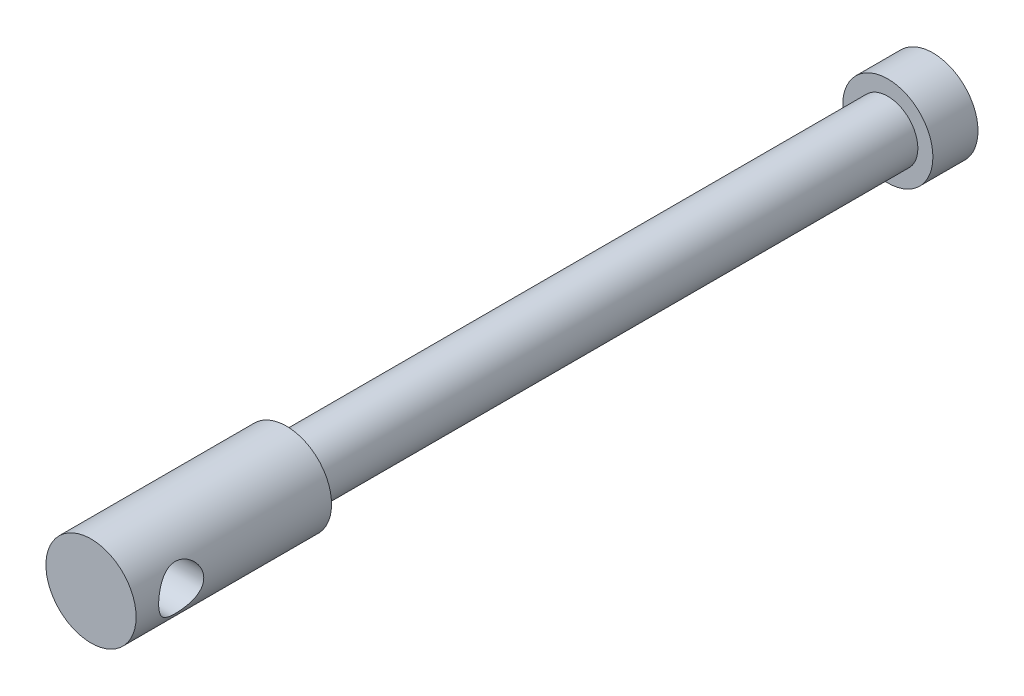
ISO-10303-21;
HEADER;
FILE_DESCRIPTION(('STEP AP214'),'2;1');
FILE_NAME('part.step','',(''),(''),'','','');
FILE_SCHEMA(('AUTOMOTIVE_DESIGN { 1 0 10303 214 1 1 1 1 }'));
ENDSEC;
DATA;
#1=APPLICATION_CONTEXT('core data for automotive mechanical design processes');
#2=APPLICATION_PROTOCOL_DEFINITION('international standard','automotive_design',2000,#1);
#3=PRODUCT_CONTEXT('',#1,'mechanical');
#4=PRODUCT('Part','Part','',(#3));
#5=PRODUCT_RELATED_PRODUCT_CATEGORY('part','',(#4));
#6=PRODUCT_DEFINITION_FORMATION('','',#4);
#7=PRODUCT_DEFINITION_CONTEXT('part definition',#1,'design');
#8=PRODUCT_DEFINITION('design','',#6,#7);
#9=PRODUCT_DEFINITION_SHAPE('','',#8);
#10=(LENGTH_UNIT() NAMED_UNIT(*) SI_UNIT(.MILLI.,.METRE.));
#11=(NAMED_UNIT(*) PLANE_ANGLE_UNIT() SI_UNIT($,.RADIAN.));
#12=(NAMED_UNIT(*) SI_UNIT($,.STERADIAN.) SOLID_ANGLE_UNIT());
#13=UNCERTAINTY_MEASURE_WITH_UNIT(LENGTH_MEASURE(1.E-05),#10,'distance_accuracy_value','');
#14=(GEOMETRIC_REPRESENTATION_CONTEXT(3) GLOBAL_UNCERTAINTY_ASSIGNED_CONTEXT((#13)) GLOBAL_UNIT_ASSIGNED_CONTEXT((#10,
#11,#12)) REPRESENTATION_CONTEXT('',''));
#15=CARTESIAN_POINT('',(0.,0.,0.));
#16=DIRECTION('',(0.,0.,1.));
#17=DIRECTION('',(1.,0.,0.));
#18=AXIS2_PLACEMENT_3D('',#15,#16,#17);
#19=CARTESIAN_POINT('',(0.,0.,17.804347826087));
#20=DIRECTION('',(0.,0.,1.));
#21=DIRECTION('',(1.,0.,0.));
#22=AXIS2_PLACEMENT_3D('',#19,#20,#21);
#23=CYLINDRICAL_SURFACE('',#22,3.);
#24=CARTESIAN_POINT('',(-3.,0.,8.5));
#25=CARTESIAN_POINT('',(-2.99999570107562,0.0788579444268502,8.50000495347578));
#26=CARTESIAN_POINT('',(-2.99685736529634,0.157809899546344,8.50625510968158));
#27=CARTESIAN_POINT('',(-2.98461234055735,0.313380352903344,8.53097932051231));
#28=CARTESIAN_POINT('',(-2.97549431743379,0.389994130070445,8.54947658949672));
#29=CARTESIAN_POINT('',(-2.95224419105063,0.538400317320674,8.59779071292494));
#30=CARTESIAN_POINT('',(-2.93813158766306,0.61021020440872,8.62756357637195));
#31=CARTESIAN_POINT('',(-2.90618664773642,0.747708925209899,8.69735593204748));
#32=CARTESIAN_POINT('',(-2.88835460450288,0.81339824098509,8.73737461637329));
#33=CARTESIAN_POINT('',(-2.84934387387093,0.941261726642865,8.82927587422793));
#34=CARTESIAN_POINT('',(-2.82802798691306,1.00298281668316,8.88172971885946));
#35=CARTESIAN_POINT('',(-2.78489955370114,1.11716916730047,8.99578221887055));
#36=CARTESIAN_POINT('',(-2.76308664313552,1.16962737466015,9.05738777765866));
#37=CARTESIAN_POINT('',(-2.71948426796021,1.26787800067542,9.19372502428507));
#38=CARTESIAN_POINT('',(-2.69782780455198,1.31283800332746,9.26910414751887));
#39=CARTESIAN_POINT('',(-2.65928968158481,1.38925234033604,9.42755100397932));
#40=CARTESIAN_POINT('',(-2.64240461410484,1.4207163224495,9.51061319308412));
#41=CARTESIAN_POINT('',(-2.61686800556713,1.46719866328288,9.67699765813288));
#42=CARTESIAN_POINT('',(-2.6077840737557,1.48308878562066,9.76000667810109));
#43=CARTESIAN_POINT('',(-2.59772834922791,1.50064048996327,9.92796825666921));
#44=CARTESIAN_POINT('',(-2.59674854014932,1.50231613255961,10.0129188113067));
#45=CARTESIAN_POINT('',(-2.60266395385873,1.49203093075844,10.1714290364731));
#46=CARTESIAN_POINT('',(-2.6086314549302,1.48167683930523,10.2451360468346));
#47=CARTESIAN_POINT('',(-2.62614343100775,1.4504097735854,10.3895828640596));
#48=CARTESIAN_POINT('',(-2.63768968247664,1.42949343584648,10.460321717958));
#49=CARTESIAN_POINT('',(-2.66531214619111,1.37731467057901,10.5988436988485));
#50=CARTESIAN_POINT('',(-2.68148760995998,1.34582260067399,10.6665195981787));
#51=CARTESIAN_POINT('',(-2.71655106422105,1.273562531502,10.795951438885));
#52=CARTESIAN_POINT('',(-2.73544027170286,1.2327903657187,10.8577047034001));
#53=CARTESIAN_POINT('',(-2.77669736854929,1.13709908236918,10.9817818791148));
#54=CARTESIAN_POINT('',(-2.79920265355119,1.08104168755392,11.0431853103642));
#55=CARTESIAN_POINT('',(-2.84321434950611,0.959333368112061,11.1561031278864));
#56=CARTESIAN_POINT('',(-2.86472027938201,0.893677884861429,11.2076127880508));
#57=CARTESIAN_POINT('',(-2.90552980924446,0.750774758747774,11.3015284915446));
#58=CARTESIAN_POINT('',(-2.92468476243011,0.673130387399115,11.3434007086686));
#59=CARTESIAN_POINT('',(-2.95736821681863,0.510699323233196,11.4131455435645));
#60=CARTESIAN_POINT('',(-2.9709011841533,0.425918364397914,11.4410292775227));
#61=CARTESIAN_POINT('',(-2.98986500612153,0.259149737491053,11.479713105575));
#62=CARTESIAN_POINT('',(-2.99587407451965,0.177512295822489,11.4917368536202));
#63=CARTESIAN_POINT('',(-3.00109520188655,0.0131693999240272,11.5021970967017));
#64=CARTESIAN_POINT('',(-3.00031048081978,-0.0695355298048635,11.5006400284592));
#65=CARTESIAN_POINT('',(-2.99236788380152,-0.226849457978981,11.4846899673719));
#66=CARTESIAN_POINT('',(-2.98570868532252,-0.301589112074895,11.471301200905));
#67=CARTESIAN_POINT('',(-2.9673325697226,-0.447610338452912,11.4336428921573));
#68=CARTESIAN_POINT('',(-2.95561509501618,-0.518891528536631,11.4093721503198));
#69=CARTESIAN_POINT('',(-2.92776377120382,-0.65833291267436,11.3500023003505));
#70=CARTESIAN_POINT('',(-2.91151322654446,-0.726345595508706,11.3146134248256));
#71=CARTESIAN_POINT('',(-2.87615961476126,-0.855692042548908,11.2343386965301));
#72=CARTESIAN_POINT('',(-2.85705533350407,-0.917022944664888,11.1894487981069));
#73=CARTESIAN_POINT('',(-2.81562332004297,-1.03765153393382,11.0863593620039));
#74=CARTESIAN_POINT('',(-2.79316327265249,-1.09615811672854,11.0272856973323));
#75=CARTESIAN_POINT('',(-2.7489358741323,-1.20278448167828,10.9001122730834));
#76=CARTESIAN_POINT('',(-2.7271690110007,-1.25089707856781,10.8320063217281));
#77=CARTESIAN_POINT('',(-2.68576788309734,-1.33756187171853,10.6845345187405));
#78=CARTESIAN_POINT('',(-2.66628794383591,-1.37553824370037,10.6047831008583));
#79=CARTESIAN_POINT('',(-2.63361108441202,-1.43712423890206,10.4387348986376));
#80=CARTESIAN_POINT('',(-2.62040607332625,-1.46075237380053,10.3524467102997));
#81=CARTESIAN_POINT('',(-2.60342251538703,-1.49079253120031,10.1846346656729));
#82=CARTESIAN_POINT('',(-2.59886075197597,-1.49863949460818,10.1034486198471));
#83=CARTESIAN_POINT('',(-2.59748031962405,-1.5010337315643,9.94082939925321));
#84=CARTESIAN_POINT('',(-2.60065829439585,-1.49558676993486,9.8593963468932));
#85=CARTESIAN_POINT('',(-2.61356793076615,-1.47288918838996,9.70677474769984));
#86=CARTESIAN_POINT('',(-2.62264641723987,-1.45681247151455,9.63534929478289));
#87=CARTESIAN_POINT('',(-2.64556524281479,-1.41476303733662,9.49628782086345));
#88=CARTESIAN_POINT('',(-2.65940711354502,-1.38878713673988,9.42865302686195));
#89=CARTESIAN_POINT('',(-2.69142795546803,-1.32572361795085,9.29406272352019));
#90=CARTESIAN_POINT('',(-2.70983583593881,-1.28800670672355,9.22745814725646));
#91=CARTESIAN_POINT('',(-2.7485299745229,-1.20322645745609,9.10108819572811));
#92=CARTESIAN_POINT('',(-2.76881720693416,-1.15615825686234,9.04132640421833));
#93=CARTESIAN_POINT('',(-2.81193484737138,-1.04730498999206,8.92278702646798));
#94=CARTESIAN_POINT('',(-2.83477474959942,-0.984426634495893,8.86501134647456));
#95=CARTESIAN_POINT('',(-2.87816628389896,-0.849232209349797,8.76060552484709));
#96=CARTESIAN_POINT('',(-2.89871667939292,-0.776911084957796,8.71398139079514));
#97=CARTESIAN_POINT('',(-2.93547014349806,-0.623897395174418,8.63314545593189));
#98=CARTESIAN_POINT('',(-2.95164144740899,-0.543149255665096,8.5990237461453));
#99=CARTESIAN_POINT('',(-2.9775201194848,-0.37611315170713,8.54528774836388));
#100=CARTESIAN_POINT('',(-2.98724585044602,-0.28984169938365,8.52563222979143));
#101=CARTESIAN_POINT('',(-2.99543192870217,-0.168902919736343,8.50915388337138));
#102=CARTESIAN_POINT('',(-2.99714048010376,-0.135242819162348,8.50572603870049));
#103=CARTESIAN_POINT('',(-2.99942545465223,-0.0677275977076378,8.50114800172887));
#104=CARTESIAN_POINT('',(-3.00000184655071,-0.0338724714699429,8.49999787229468));
#105=CARTESIAN_POINT('',(-3.,0.,8.5));
#106=B_SPLINE_CURVE_WITH_KNOTS('',3,(#24,#25,#26,#27,#28,#29,#30,#31,#32,#33,#34,#35,#36,#37,
#38,#39,#40,#41,#42,#43,#44,#45,#46,#47,#48,#49,#50,#51,#52,#53,#54,#55,#56,#57,#58,#59,#60,#61,
#62,#63,#64,#65,#66,#67,#68,#69,#70,#71,#72,#73,#74,#75,#76,#77,#78,#79,#80,#81,#82,#83,#84,#85,
#86,#87,#88,#89,#90,#91,#92,#93,#94,#95,#96,#97,#98,#99,#100,#101,#102,#103,#104,#105),
.UNSPECIFIED.,.T.,.F.,(4,2,2,2,2,2,2,2,2,2,2,2,2,2,2,2,2,2,2,2,2,2,2,2,2,2,2,2,2,2,2,2,2,2,2,2,
2,2,2,2,4),(0.,0.236436386130439,0.473322224563797,0.709293233238449,0.945245640872353,
1.19547263807713,1.44588935648105,1.71572589646129,1.98536921847421,2.23887018210344,
2.49212035993531,2.71508568613981,2.93812205888518,3.16635360252731,3.39468781890333,
3.65197412000818,3.90938301898029,4.17874533321661,4.44789325368419,4.69474935707019,
4.94148846767214,5.16910359759183,5.39674382446397,5.63089284041848,5.86514176122509,
6.12239415966628,6.37982382923148,6.64972023242588,6.91926767918176,7.1629396125457,
7.40650589797018,7.62686895373284,7.84730293182527,8.08254685170431,8.31791341715446,
8.58187864135757,8.84598575071869,9.1119602049529,9.37717362931724,9.47872920200875,
9.58028757766599),.UNSPECIFIED.);
#107=CARTESIAN_POINT('',(-3.,0.,8.5));
#108=VERTEX_POINT('',#107);
#109=EDGE_CURVE('E10',#108,#108,#106,.T.);
#110=ORIENTED_EDGE('',*,*,#109,.T.);
#111=EDGE_LOOP('',(#110));
#112=FACE_BOUND('',#111,.T.);
#113=CARTESIAN_POINT('',(3.,0.,8.5));
#114=CARTESIAN_POINT('',(2.99999570107562,-0.0788579444268502,8.50000495347578));
#115=CARTESIAN_POINT('',(2.99685736529635,-0.157809899546344,8.50625510968158));
#116=CARTESIAN_POINT('',(2.98461234055735,-0.313380352903344,8.53097932051231));
#117=CARTESIAN_POINT('',(2.97549431743379,-0.389994130070444,8.54947658949672));
#118=CARTESIAN_POINT('',(2.95224419105063,-0.538400317320674,8.59779071292494));
#119=CARTESIAN_POINT('',(2.93813158766306,-0.61021020440872,8.62756357637195));
#120=CARTESIAN_POINT('',(2.90618664773642,-0.747708925209899,8.69735593204748));
#121=CARTESIAN_POINT('',(2.88835460450288,-0.813398240985089,8.73737461637329));
#122=CARTESIAN_POINT('',(2.84934387387093,-0.941261726642864,8.82927587422793));
#123=CARTESIAN_POINT('',(2.82802798691306,-1.00298281668316,8.88172971885946));
#124=CARTESIAN_POINT('',(2.78489955370114,-1.11716916730047,8.99578221887055));
#125=CARTESIAN_POINT('',(2.76308664313552,-1.16962737466015,9.05738777765866));
#126=CARTESIAN_POINT('',(2.71948426796021,-1.26787800067542,9.19372502428507));
#127=CARTESIAN_POINT('',(2.69782780455198,-1.31283800332746,9.26910414751887));
#128=CARTESIAN_POINT('',(2.65928968158481,-1.38925234033604,9.42755100397932));
#129=CARTESIAN_POINT('',(2.64240461410484,-1.4207163224495,9.51061319308412));
#130=CARTESIAN_POINT('',(2.61686800556713,-1.46719866328288,9.67699765813288));
#131=CARTESIAN_POINT('',(2.6077840737557,-1.48308878562066,9.76000667810109));
#132=CARTESIAN_POINT('',(2.59772834922791,-1.50064048996327,9.92796825666921));
#133=CARTESIAN_POINT('',(2.59674854014932,-1.50231613255961,10.0129188113067));
#134=CARTESIAN_POINT('',(2.60266395385873,-1.49203093075844,10.1714290364731));
#135=CARTESIAN_POINT('',(2.6086314549302,-1.48167683930523,10.2451360468346));
#136=CARTESIAN_POINT('',(2.62614343100775,-1.4504097735854,10.3895828640596));
#137=CARTESIAN_POINT('',(2.63768968247664,-1.42949343584648,10.460321717958));
#138=CARTESIAN_POINT('',(2.66531214619111,-1.37731467057901,10.5988436988485));
#139=CARTESIAN_POINT('',(2.68148760995998,-1.34582260067399,10.6665195981787));
#140=CARTESIAN_POINT('',(2.71655106422105,-1.273562531502,10.795951438885));
#141=CARTESIAN_POINT('',(2.73544027170286,-1.2327903657187,10.8577047034001));
#142=CARTESIAN_POINT('',(2.77669736854929,-1.13709908236918,10.9817818791148));
#143=CARTESIAN_POINT('',(2.79920265355119,-1.08104168755392,11.0431853103642));
#144=CARTESIAN_POINT('',(2.84321434950611,-0.959333368112062,11.1561031278864));
#145=CARTESIAN_POINT('',(2.86472027938201,-0.893677884861429,11.2076127880508));
#146=CARTESIAN_POINT('',(2.90552980924446,-0.750774758747774,11.3015284915446));
#147=CARTESIAN_POINT('',(2.92468476243011,-0.673130387399115,11.3434007086686));
#148=CARTESIAN_POINT('',(2.95736821681863,-0.510699323233196,11.4131455435645));
#149=CARTESIAN_POINT('',(2.9709011841533,-0.425918364397914,11.4410292775227));
#150=CARTESIAN_POINT('',(2.98986500612153,-0.259149737491053,11.479713105575));
#151=CARTESIAN_POINT('',(2.99587407451965,-0.177512295822489,11.4917368536202));
#152=CARTESIAN_POINT('',(3.00109520188655,-0.0131693999240274,11.5021970967017));
#153=CARTESIAN_POINT('',(3.00031048081978,0.0695355298048631,11.5006400284592));
#154=CARTESIAN_POINT('',(2.99236788380152,0.22684945797898,11.4846899673719));
#155=CARTESIAN_POINT('',(2.98570868532252,0.301589112074895,11.471301200905));
#156=CARTESIAN_POINT('',(2.9673325697226,0.447610338452912,11.4336428921573));
#157=CARTESIAN_POINT('',(2.95561509501618,0.518891528536631,11.4093721503198));
#158=CARTESIAN_POINT('',(2.92776377120382,0.658332912674359,11.3500023003504));
#159=CARTESIAN_POINT('',(2.91151322654446,0.726345595508705,11.3146134248256));
#160=CARTESIAN_POINT('',(2.87615961476126,0.855692042548908,11.2343386965301));
#161=CARTESIAN_POINT('',(2.85705533350407,0.917022944664888,11.1894487981069));
#162=CARTESIAN_POINT('',(2.81562332004297,1.03765153393382,11.0863593620039));
#163=CARTESIAN_POINT('',(2.79316327265249,1.09615811672854,11.0272856973323));
#164=CARTESIAN_POINT('',(2.7489358741323,1.20278448167828,10.9001122730834));
#165=CARTESIAN_POINT('',(2.7271690110007,1.25089707856781,10.8320063217281));
#166=CARTESIAN_POINT('',(2.68576788309734,1.33756187171853,10.6845345187405));
#167=CARTESIAN_POINT('',(2.66628794383591,1.37553824370037,10.6047831008583));
#168=CARTESIAN_POINT('',(2.63361108441202,1.43712423890206,10.4387348986376));
#169=CARTESIAN_POINT('',(2.62040607332625,1.46075237380053,10.3524467102997));
#170=CARTESIAN_POINT('',(2.60342251538703,1.49079253120031,10.1846346656729));
#171=CARTESIAN_POINT('',(2.59886075197597,1.49863949460818,10.1034486198471));
#172=CARTESIAN_POINT('',(2.59748031962405,1.5010337315643,9.94082939925321));
#173=CARTESIAN_POINT('',(2.60065829439585,1.49558676993486,9.8593963468932));
#174=CARTESIAN_POINT('',(2.61356793076615,1.47288918838996,9.70677474769984));
#175=CARTESIAN_POINT('',(2.62264641723987,1.45681247151455,9.63534929478289));
#176=CARTESIAN_POINT('',(2.64556524281479,1.41476303733662,9.49628782086345));
#177=CARTESIAN_POINT('',(2.65940711354502,1.38878713673988,9.42865302686195));
#178=CARTESIAN_POINT('',(2.69142795546803,1.32572361795085,9.29406272352019));
#179=CARTESIAN_POINT('',(2.70983583593881,1.28800670672355,9.22745814725646));
#180=CARTESIAN_POINT('',(2.7485299745229,1.20322645745609,9.10108819572811));
#181=CARTESIAN_POINT('',(2.76881720693416,1.15615825686234,9.04132640421833));
#182=CARTESIAN_POINT('',(2.81193484737138,1.04730498999206,8.92278702646798));
#183=CARTESIAN_POINT('',(2.83477474959942,0.984426634495893,8.86501134647456));
#184=CARTESIAN_POINT('',(2.87816628389896,0.849232209349796,8.76060552484709));
#185=CARTESIAN_POINT('',(2.89871667939292,0.776911084957796,8.71398139079514));
#186=CARTESIAN_POINT('',(2.93547014349806,0.623897395174419,8.63314545593189));
#187=CARTESIAN_POINT('',(2.95164144740899,0.543149255665096,8.5990237461453));
#188=CARTESIAN_POINT('',(2.9775201194848,0.37611315170713,8.54528774836388));
#189=CARTESIAN_POINT('',(2.98724585044602,0.28984169938365,8.52563222979143));
#190=CARTESIAN_POINT('',(2.99543192870217,0.168902919736343,8.50915388337138));
#191=CARTESIAN_POINT('',(2.99714048010376,0.135242819162348,8.50572603870049));
#192=CARTESIAN_POINT('',(2.99942545465223,0.0677275977076377,8.50114800172887));
#193=CARTESIAN_POINT('',(3.00000184655071,0.0338724714699428,8.49999787229468));
#194=CARTESIAN_POINT('',(3.,0.,8.5));
#195=B_SPLINE_CURVE_WITH_KNOTS('',3,(#113,#114,#115,#116,#117,#118,#119,#120,#121,#122,#123,
#124,#125,#126,#127,#128,#129,#130,#131,#132,#133,#134,#135,#136,#137,#138,#139,#140,#141,#142,
#143,#144,#145,#146,#147,#148,#149,#150,#151,#152,#153,#154,#155,#156,#157,#158,#159,#160,#161,
#162,#163,#164,#165,#166,#167,#168,#169,#170,#171,#172,#173,#174,#175,#176,#177,#178,#179,#180,
#181,#182,#183,#184,#185,#186,#187,#188,#189,#190,#191,#192,#193,#194),.UNSPECIFIED.,.T.,.F.,(4,
2,2,2,2,2,2,2,2,2,2,2,2,2,2,2,2,2,2,2,2,2,2,2,2,2,2,2,2,2,2,2,2,2,2,2,2,2,2,2,4),(0.,
0.236436386130439,0.473322224563797,0.709293233238449,0.945245640872353,1.19547263807713,
1.44588935648105,1.71572589646129,1.98536921847421,2.23887018210344,2.49212035993531,
2.71508568613981,2.93812205888518,3.16635360252731,3.39468781890333,3.65197412000818,
3.90938301898029,4.17874533321661,4.44789325368419,4.69474935707019,4.94148846767214,
5.16910359759183,5.39674382446397,5.63089284041848,5.86514176122509,6.12239415966628,
6.37982382923148,6.64972023242589,6.91926767918176,7.1629396125457,7.40650589797018,
7.62686895373284,7.84730293182527,8.08254685170431,8.31791341715446,8.58187864135758,
8.84598575071869,9.1119602049529,9.37717362931724,9.47872920200876,9.58028757766599),.UNSPECIFIED.);
#196=CARTESIAN_POINT('',(3.,0.,8.5));
#197=VERTEX_POINT('',#196);
#198=EDGE_CURVE('E46',#197,#197,#195,.T.);
#199=ORIENTED_EDGE('',*,*,#198,.T.);
#200=EDGE_LOOP('',(#199));
#201=FACE_BOUND('',#200,.T.);
#202=CARTESIAN_POINT('',(0.,0.,13.));
#203=DIRECTION('',(0.,0.,1.));
#204=DIRECTION('',(1.,0.,0.));
#205=AXIS2_PLACEMENT_3D('',#202,#203,#204);
#206=CIRCLE('',#205,3.);
#207=CARTESIAN_POINT('',(3.,0.,13.));
#208=VERTEX_POINT('',#207);
#209=EDGE_CURVE('E50',#208,#208,#206,.T.);
#210=ORIENTED_EDGE('',*,*,#209,.F.);
#211=EDGE_LOOP('',(#210));
#212=FACE_BOUND('',#211,.T.);
#213=CARTESIAN_POINT('',(0.,0.,0.));
#214=DIRECTION('',(0.,0.,1.));
#215=DIRECTION('',(1.,0.,0.));
#216=AXIS2_PLACEMENT_3D('',#213,#214,#215);
#217=CIRCLE('',#216,3.);
#218=CARTESIAN_POINT('',(3.,0.,0.));
#219=VERTEX_POINT('',#218);
#220=EDGE_CURVE('E96',#219,#219,#217,.T.);
#221=ORIENTED_EDGE('',*,*,#220,.T.);
#222=EDGE_LOOP('',(#221));
#223=FACE_BOUND('',#222,.T.);
#224=ADVANCED_FACE('F35',(#112,#201,#212,#223),#23,.T.);
#225=CARTESIAN_POINT('',(0.,3.,13.));
#226=DIRECTION('',(0.,0.,-1.));
#227=DIRECTION('',(-1.,0.,0.));
#228=AXIS2_PLACEMENT_3D('',#225,#226,#227);
#229=PLANE('',#228);
#230=ORIENTED_EDGE('',*,*,#209,.T.);
#231=EDGE_LOOP('',(#230));
#232=FACE_BOUND('',#231,.T.);
#233=ADVANCED_FACE('F84',(#232),#229,.F.);
#234=CARTESIAN_POINT('',(0.,3.,-43.));
#235=DIRECTION('',(0.,0.,1.));
#236=DIRECTION('',(1.,0.,0.));
#237=AXIS2_PLACEMENT_3D('',#234,#235,#236);
#238=PLANE('',#237);
#239=CARTESIAN_POINT('',(0.,0.,-43.));
#240=DIRECTION('',(0.,0.,1.));
#241=DIRECTION('',(1.,0.,0.));
#242=AXIS2_PLACEMENT_3D('',#239,#240,#241);
#243=CIRCLE('',#242,3.);
#244=CARTESIAN_POINT('',(3.,0.,-43.));
#245=VERTEX_POINT('',#244);
#246=EDGE_CURVE('E54',#245,#245,#243,.T.);
#247=ORIENTED_EDGE('',*,*,#246,.F.);
#248=EDGE_LOOP('',(#247));
#249=FACE_BOUND('',#248,.T.);
#250=ADVANCED_FACE('F81',(#249),#238,.F.);
#251=CARTESIAN_POINT('',(0.,0.,17.804347826087));
#252=DIRECTION('',(0.,0.,1.));
#253=DIRECTION('',(1.,0.,0.));
#254=AXIS2_PLACEMENT_3D('',#251,#252,#253);
#255=CYLINDRICAL_SURFACE('',#254,3.);
#256=CARTESIAN_POINT('',(0.,0.,-40.));
#257=DIRECTION('',(0.,0.,1.));
#258=DIRECTION('',(1.,0.,0.));
#259=AXIS2_PLACEMENT_3D('',#256,#257,#258);
#260=CIRCLE('',#259,3.);
#261=CARTESIAN_POINT('',(3.,0.,-40.));
#262=VERTEX_POINT('',#261);
#263=EDGE_CURVE('E105',#262,#262,#260,.T.);
#264=ORIENTED_EDGE('',*,*,#263,.F.);
#265=EDGE_LOOP('',(#264));
#266=FACE_BOUND('',#265,.T.);
#267=ORIENTED_EDGE('',*,*,#246,.T.);
#268=EDGE_LOOP('',(#267));
#269=FACE_BOUND('',#268,.T.);
#270=ADVANCED_FACE('F77',(#266,#269),#255,.T.);
#271=CARTESIAN_POINT('',(0.,2.,-40.));
#272=DIRECTION('',(0.,0.,-1.));
#273=DIRECTION('',(-1.,0.,0.));
#274=AXIS2_PLACEMENT_3D('',#271,#272,#273);
#275=PLANE('',#274);
#276=CARTESIAN_POINT('',(0.,0.,-40.));
#277=DIRECTION('',(0.,0.,1.));
#278=DIRECTION('',(1.,0.,0.));
#279=AXIS2_PLACEMENT_3D('',#276,#277,#278);
#280=CIRCLE('',#279,2.);
#281=CARTESIAN_POINT('',(2.,0.,-40.));
#282=VERTEX_POINT('',#281);
#283=EDGE_CURVE('E100',#282,#282,#280,.T.);
#284=ORIENTED_EDGE('',*,*,#283,.F.);
#285=EDGE_LOOP('',(#284));
#286=FACE_BOUND('',#285,.T.);
#287=ORIENTED_EDGE('',*,*,#263,.T.);
#288=EDGE_LOOP('',(#287));
#289=FACE_BOUND('',#288,.T.);
#290=ADVANCED_FACE('F73',(#286,#289),#275,.F.);
#291=CARTESIAN_POINT('',(0.,0.,17.804347826087));
#292=DIRECTION('',(0.,0.,1.));
#293=DIRECTION('',(1.,0.,0.));
#294=AXIS2_PLACEMENT_3D('',#291,#292,#293);
#295=CYLINDRICAL_SURFACE('',#294,2.);
#296=CARTESIAN_POINT('',(0.,0.,0.));
#297=DIRECTION('',(0.,0.,1.));
#298=DIRECTION('',(1.,0.,0.));
#299=AXIS2_PLACEMENT_3D('',#296,#297,#298);
#300=CIRCLE('',#299,2.);
#301=CARTESIAN_POINT('',(2.,0.,0.));
#302=VERTEX_POINT('',#301);
#303=EDGE_CURVE('E97',#302,#302,#300,.T.);
#304=ORIENTED_EDGE('',*,*,#303,.F.);
#305=EDGE_LOOP('',(#304));
#306=FACE_BOUND('',#305,.T.);
#307=ORIENTED_EDGE('',*,*,#283,.T.);
#308=EDGE_LOOP('',(#307));
#309=FACE_BOUND('',#308,.T.);
#310=ADVANCED_FACE('F69',(#306,#309),#295,.T.);
#311=CARTESIAN_POINT('',(0.,2.,0.));
#312=DIRECTION('',(0.,0.,1.));
#313=DIRECTION('',(1.,0.,0.));
#314=AXIS2_PLACEMENT_3D('',#311,#312,#313);
#315=PLANE('',#314);
#316=ORIENTED_EDGE('',*,*,#220,.F.);
#317=EDGE_LOOP('',(#316));
#318=FACE_BOUND('',#317,.T.);
#319=ORIENTED_EDGE('',*,*,#303,.T.);
#320=EDGE_LOOP('',(#319));
#321=FACE_BOUND('',#320,.T.);
#322=ADVANCED_FACE('F64',(#318,#321),#315,.F.);
#323=CARTESIAN_POINT('',(-3.,0.,10.));
#324=DIRECTION('',(1.,0.,0.));
#325=DIRECTION('',(0.,0.,-1.));
#326=AXIS2_PLACEMENT_3D('',#323,#324,#325);
#327=CYLINDRICAL_SURFACE('',#326,1.5);
#328=ORIENTED_EDGE('',*,*,#198,.F.);
#329=EDGE_LOOP('',(#328));
#330=FACE_BOUND('',#329,.T.);
#331=ORIENTED_EDGE('',*,*,#109,.F.);
#332=EDGE_LOOP('',(#331));
#333=FACE_BOUND('',#332,.T.);
#334=ADVANCED_FACE('F60',(#330,#333),#327,.F.);
#335=CLOSED_SHELL('',(#224,#233,#250,#270,#290,#310,#322,#334));
#336=MANIFOLD_SOLID_BREP('B2',#335);
#337=ADVANCED_BREP_SHAPE_REPRESENTATION('',(#18,#336),#14);
#338=SHAPE_DEFINITION_REPRESENTATION(#9,#337);
ENDSEC;
END-ISO-10303-21;
